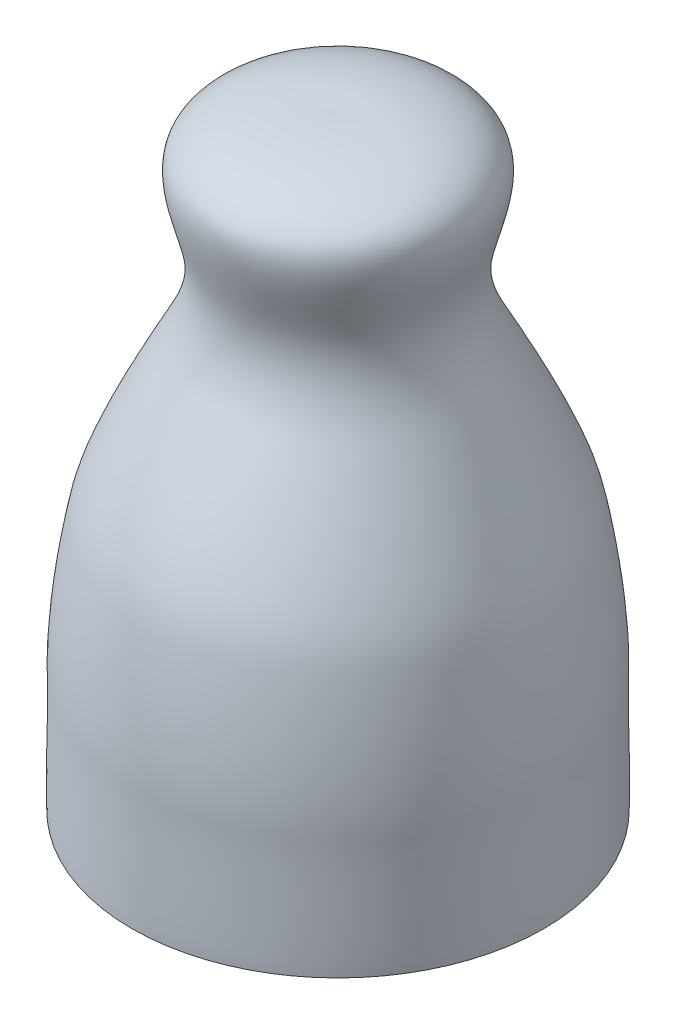
ISO-10303-21;
HEADER;
FILE_DESCRIPTION(('STEP AP214'),'2;1');
FILE_NAME('part.step','',(''),(''),'','','');
FILE_SCHEMA(('AUTOMOTIVE_DESIGN { 1 0 10303 214 1 1 1 1 }'));
ENDSEC;
DATA;
#1=APPLICATION_CONTEXT('core data for automotive mechanical design processes');
#2=APPLICATION_PROTOCOL_DEFINITION('international standard','automotive_design',2000,#1);
#3=PRODUCT_CONTEXT('',#1,'mechanical');
#4=PRODUCT('Part','Part','',(#3));
#5=PRODUCT_RELATED_PRODUCT_CATEGORY('part','',(#4));
#6=PRODUCT_DEFINITION_FORMATION('','',#4);
#7=PRODUCT_DEFINITION_CONTEXT('part definition',#1,'design');
#8=PRODUCT_DEFINITION('design','',#6,#7);
#9=PRODUCT_DEFINITION_SHAPE('','',#8);
#10=(LENGTH_UNIT() NAMED_UNIT(*) SI_UNIT(.MILLI.,.METRE.));
#11=(NAMED_UNIT(*) PLANE_ANGLE_UNIT() SI_UNIT($,.RADIAN.));
#12=(NAMED_UNIT(*) SI_UNIT($,.STERADIAN.) SOLID_ANGLE_UNIT());
#13=UNCERTAINTY_MEASURE_WITH_UNIT(LENGTH_MEASURE(1.E-05),#10,'distance_accuracy_value','');
#14=(GEOMETRIC_REPRESENTATION_CONTEXT(3) GLOBAL_UNCERTAINTY_ASSIGNED_CONTEXT((#13)) GLOBAL_UNIT_ASSIGNED_CONTEXT((#10,
#11,#12)) REPRESENTATION_CONTEXT('',''));
#15=CARTESIAN_POINT('',(0.,0.,0.));
#16=DIRECTION('',(0.,0.,1.));
#17=DIRECTION('',(1.,0.,0.));
#18=AXIS2_PLACEMENT_3D('',#15,#16,#17);
#19=CARTESIAN_POINT('',(34.,0.,0.));
#20=CARTESIAN_POINT('',(34.1456226593328,3.55490993567874,0.));
#21=CARTESIAN_POINT('',(33.8158202531303,15.5114464961728,0.));
#22=CARTESIAN_POINT('',(34.1490883727656,25.8687305822525,0.));
#23=CARTESIAN_POINT('',(32.6586770273559,36.7537451716756,0.));
#24=CARTESIAN_POINT('',(30.2300430833478,48.5392206957842,0.));
#25=CARTESIAN_POINT('',(21.6389129646176,65.7019406086251,0.));
#26=CARTESIAN_POINT('',(19.2615582262799,69.7370922879908,0.));
#27=CARTESIAN_POINT('',(16.3382298361312,79.7631300353851,0.));
#28=CARTESIAN_POINT('',(25.9759549180631,98.8056867832417,0.));
#29=CARTESIAN_POINT('',(5.69007626364354,100.497767161139,0.));
#30=CARTESIAN_POINT('',(0.,100.,0.));
#31=B_SPLINE_CURVE_WITH_KNOTS('',3,(#19,#20,#21,#22,#23,#24,#25,#26,#27,#28,#29,#30),
.UNSPECIFIED.,.F.,.F.,(4,1,1,1,1,1,1,1,1,4),(0.,0.0844299377430298,0.114529910417486,
0.28028085826378,0.317517879370884,0.466181253007735,0.574763899914356,0.675979240121234,
0.807631293715448,1.),.UNSPECIFIED.);
#32=CARTESIAN_POINT('',(0.,100.,0.));
#33=DIRECTION('',(0.,1.,0.));
#34=AXIS1_PLACEMENT('',#32,#33);
#35=SURFACE_OF_REVOLUTION('',#31,#34);
#36=CARTESIAN_POINT('',(0.,100.,0.));
#37=VERTEX_POINT('',#36);
#38=VERTEX_LOOP('',#37);
#39=FACE_BOUND('',#38,.T.);
#40=CARTESIAN_POINT('',(0.,0.,0.));
#41=DIRECTION('',(0.,1.,0.));
#42=DIRECTION('',(0.,0.,1.));
#43=AXIS2_PLACEMENT_3D('',#40,#41,#42);
#44=CIRCLE('',#43,34.);
#45=CARTESIAN_POINT('',(0.,0.,34.));
#46=VERTEX_POINT('',#45);
#47=EDGE_CURVE('E11',#46,#46,#44,.T.);
#48=ORIENTED_EDGE('',*,*,#47,.T.);
#49=EDGE_LOOP('',(#48));
#50=FACE_BOUND('',#49,.T.);
#51=ADVANCED_FACE('F35',(#39,#50),#35,.T.);
#52=CARTESIAN_POINT('',(0.,0.,0.));
#53=DIRECTION('',(0.,1.,0.));
#54=DIRECTION('',(0.,0.,1.));
#55=AXIS2_PLACEMENT_3D('',#52,#53,#54);
#56=PLANE('',#55);
#57=ORIENTED_EDGE('',*,*,#47,.F.);
#58=EDGE_LOOP('',(#57));
#59=FACE_BOUND('',#58,.T.);
#60=ADVANCED_FACE('F45',(#59),#56,.F.);
#61=CLOSED_SHELL('',(#51,#60));
#62=MANIFOLD_SOLID_BREP('B2',#61);
#63=ADVANCED_BREP_SHAPE_REPRESENTATION('',(#18,#62),#14);
#64=SHAPE_DEFINITION_REPRESENTATION(#9,#63);
ENDSEC;
END-ISO-10303-21;
